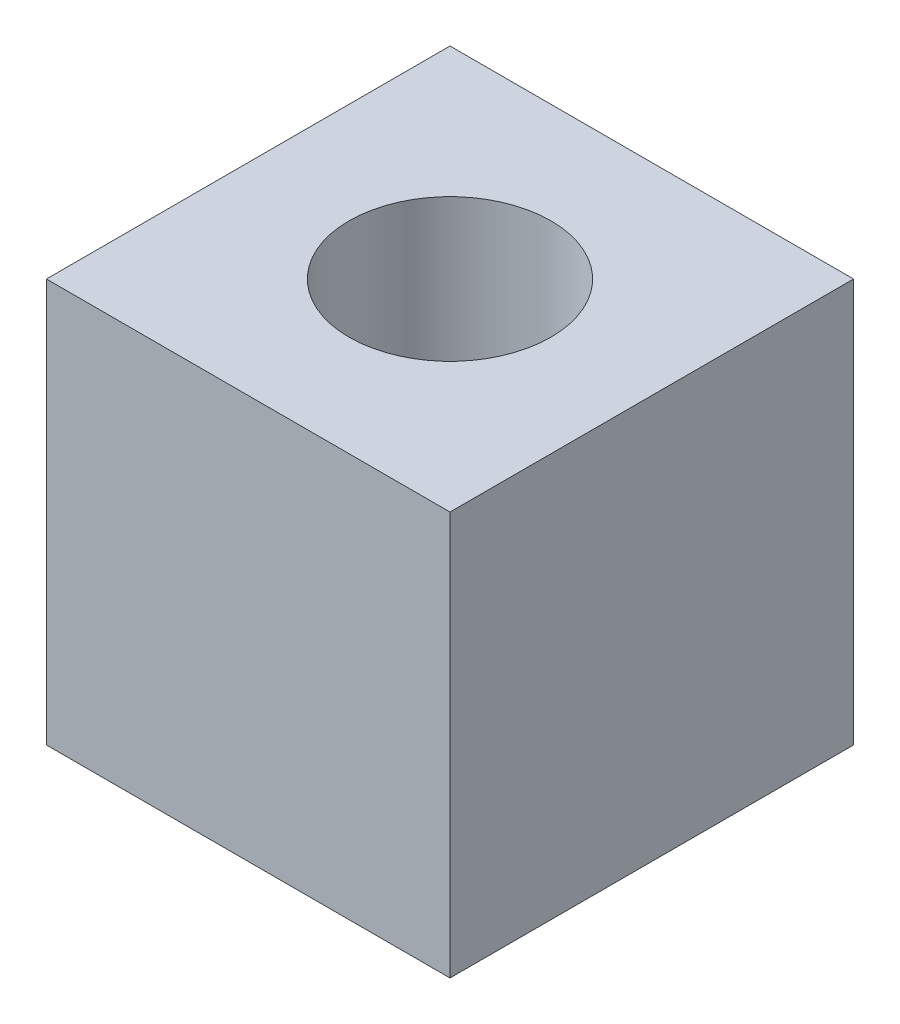
ISO-10303-21;
HEADER;
FILE_DESCRIPTION(('STEP AP214'),'2;1');
FILE_NAME('part.step','',(''),(''),'','','');
FILE_SCHEMA(('AUTOMOTIVE_DESIGN { 1 0 10303 214 1 1 1 1 }'));
ENDSEC;
DATA;
#1=APPLICATION_CONTEXT('core data for automotive mechanical design processes');
#2=APPLICATION_PROTOCOL_DEFINITION('international standard','automotive_design',2000,#1);
#3=PRODUCT_CONTEXT('',#1,'mechanical');
#4=PRODUCT('Part','Part','',(#3));
#5=PRODUCT_RELATED_PRODUCT_CATEGORY('part','',(#4));
#6=PRODUCT_DEFINITION_FORMATION('','',#4);
#7=PRODUCT_DEFINITION_CONTEXT('part definition',#1,'design');
#8=PRODUCT_DEFINITION('design','',#6,#7);
#9=PRODUCT_DEFINITION_SHAPE('','',#8);
#10=(LENGTH_UNIT() NAMED_UNIT(*) SI_UNIT(.MILLI.,.METRE.));
#11=(NAMED_UNIT(*) PLANE_ANGLE_UNIT() SI_UNIT($,.RADIAN.));
#12=(NAMED_UNIT(*) SI_UNIT($,.STERADIAN.) SOLID_ANGLE_UNIT());
#13=UNCERTAINTY_MEASURE_WITH_UNIT(LENGTH_MEASURE(1.E-05),#10,'distance_accuracy_value','');
#14=(GEOMETRIC_REPRESENTATION_CONTEXT(3) GLOBAL_UNCERTAINTY_ASSIGNED_CONTEXT((#13)) GLOBAL_UNIT_ASSIGNED_CONTEXT((#10,
#11,#12)) REPRESENTATION_CONTEXT('',''));
#15=CARTESIAN_POINT('',(0.,0.,0.));
#16=DIRECTION('',(0.,0.,1.));
#17=DIRECTION('',(1.,0.,0.));
#18=AXIS2_PLACEMENT_3D('',#15,#16,#17);
#19=CARTESIAN_POINT('',(0.,0.,50.8));
#20=DIRECTION('',(1.,0.,0.));
#21=DIRECTION('',(0.,1.,0.));
#22=AXIS2_PLACEMENT_3D('',#19,#20,#21);
#23=PLANE('',#22);
#24=DIRECTION('',(0.,-1.,0.));
#25=VECTOR('',#24,1.);
#26=CARTESIAN_POINT('',(0.,0.,0.));
#27=LINE('',#26,#25);
#28=CARTESIAN_POINT('',(0.,0.,0.));
#29=VERTEX_POINT('',#28);
#30=CARTESIAN_POINT('',(0.,-50.8,0.));
#31=VERTEX_POINT('',#30);
#32=EDGE_CURVE('E95',#29,#31,#27,.T.);
#33=ORIENTED_EDGE('',*,*,#32,.T.);
#34=DIRECTION('',(0.,0.,-1.));
#35=VECTOR('',#34,1.);
#36=CARTESIAN_POINT('',(0.,-50.8,50.8));
#37=LINE('',#36,#35);
#38=CARTESIAN_POINT('',(0.,-50.8,50.8));
#39=VERTEX_POINT('',#38);
#40=EDGE_CURVE('E11',#39,#31,#37,.T.);
#41=ORIENTED_EDGE('',*,*,#40,.F.);
#42=DIRECTION('',(0.,-1.,0.));
#43=VECTOR('',#42,1.);
#44=CARTESIAN_POINT('',(0.,0.,50.8));
#45=LINE('',#44,#43);
#46=CARTESIAN_POINT('',(0.,0.,50.8));
#47=VERTEX_POINT('',#46);
#48=EDGE_CURVE('E83',#47,#39,#45,.T.);
#49=ORIENTED_EDGE('',*,*,#48,.F.);
#50=DIRECTION('',(0.,0.,-1.));
#51=VECTOR('',#50,1.);
#52=CARTESIAN_POINT('',(0.,0.,50.8));
#53=LINE('',#52,#51);
#54=EDGE_CURVE('E91',#47,#29,#53,.T.);
#55=ORIENTED_EDGE('',*,*,#54,.T.);
#56=EDGE_LOOP('',(#33,#41,#49,#55));
#57=FACE_BOUND('',#56,.T.);
#58=ADVANCED_FACE('F32',(#57),#23,.F.);
#59=CARTESIAN_POINT('',(0.,-50.8,50.8));
#60=DIRECTION('',(0.,1.,0.));
#61=DIRECTION('',(0.,0.,1.));
#62=AXIS2_PLACEMENT_3D('',#59,#60,#61);
#63=PLANE('',#62);
#64=CARTESIAN_POINT('',(25.4,-50.8,25.4));
#65=DIRECTION('',(0.,1.,0.));
#66=DIRECTION('',(0.,0.,1.));
#67=AXIS2_PLACEMENT_3D('',#64,#65,#66);
#68=CIRCLE('',#67,12.7);
#69=CARTESIAN_POINT('',(25.4,-50.8,38.1));
#70=VERTEX_POINT('',#69);
#71=EDGE_CURVE('E98',#70,#70,#68,.F.);
#72=ORIENTED_EDGE('',*,*,#71,.F.);
#73=EDGE_LOOP('',(#72));
#74=FACE_BOUND('',#73,.T.);
#75=DIRECTION('',(1.,0.,0.));
#76=VECTOR('',#75,1.);
#77=CARTESIAN_POINT('',(0.,-50.8,0.));
#78=LINE('',#77,#76);
#79=CARTESIAN_POINT('',(50.8,-50.8,0.));
#80=VERTEX_POINT('',#79);
#81=EDGE_CURVE('E87',#31,#80,#78,.T.);
#82=ORIENTED_EDGE('',*,*,#81,.T.);
#83=DIRECTION('',(0.,0.,-1.));
#84=VECTOR('',#83,1.);
#85=CARTESIAN_POINT('',(50.8,-50.8,50.8));
#86=LINE('',#85,#84);
#87=CARTESIAN_POINT('',(50.8,-50.8,50.8));
#88=VERTEX_POINT('',#87);
#89=EDGE_CURVE('E40',#88,#80,#86,.T.);
#90=ORIENTED_EDGE('',*,*,#89,.F.);
#91=DIRECTION('',(1.,0.,0.));
#92=VECTOR('',#91,1.);
#93=CARTESIAN_POINT('',(0.,-50.8,50.8));
#94=LINE('',#93,#92);
#95=EDGE_CURVE('E78',#39,#88,#94,.T.);
#96=ORIENTED_EDGE('',*,*,#95,.F.);
#97=ORIENTED_EDGE('',*,*,#40,.T.);
#98=EDGE_LOOP('',(#82,#90,#96,#97));
#99=FACE_BOUND('',#98,.T.);
#100=ADVANCED_FACE('F86',(#74,#99),#63,.F.);
#101=CARTESIAN_POINT('',(50.8,0.,50.8));
#102=DIRECTION('',(-1.,0.,0.));
#103=DIRECTION('',(0.,-1.,0.));
#104=AXIS2_PLACEMENT_3D('',#101,#102,#103);
#105=PLANE('',#104);
#106=DIRECTION('',(0.,1.,0.));
#107=VECTOR('',#106,1.);
#108=CARTESIAN_POINT('',(50.8,0.,0.));
#109=LINE('',#108,#107);
#110=CARTESIAN_POINT('',(50.8,0.,0.));
#111=VERTEX_POINT('',#110);
#112=EDGE_CURVE('E65',#80,#111,#109,.T.);
#113=ORIENTED_EDGE('',*,*,#112,.T.);
#114=DIRECTION('',(0.,0.,-1.));
#115=VECTOR('',#114,1.);
#116=CARTESIAN_POINT('',(50.8,0.,50.8));
#117=LINE('',#116,#115);
#118=CARTESIAN_POINT('',(50.8,0.,50.8));
#119=VERTEX_POINT('',#118);
#120=EDGE_CURVE('E88',#119,#111,#117,.T.);
#121=ORIENTED_EDGE('',*,*,#120,.F.);
#122=DIRECTION('',(0.,1.,0.));
#123=VECTOR('',#122,1.);
#124=CARTESIAN_POINT('',(50.8,0.,50.8));
#125=LINE('',#124,#123);
#126=EDGE_CURVE('E81',#88,#119,#125,.T.);
#127=ORIENTED_EDGE('',*,*,#126,.F.);
#128=ORIENTED_EDGE('',*,*,#89,.T.);
#129=EDGE_LOOP('',(#113,#121,#127,#128));
#130=FACE_BOUND('',#129,.T.);
#131=ADVANCED_FACE('F89',(#130),#105,.F.);
#132=CARTESIAN_POINT('',(0.,0.,50.8));
#133=DIRECTION('',(0.,-1.,0.));
#134=DIRECTION('',(0.,0.,-1.));
#135=AXIS2_PLACEMENT_3D('',#132,#133,#134);
#136=PLANE('',#135);
#137=CARTESIAN_POINT('',(25.4,0.,25.4));
#138=DIRECTION('',(0.,1.,0.));
#139=DIRECTION('',(0.,0.,1.));
#140=AXIS2_PLACEMENT_3D('',#137,#138,#139);
#141=CIRCLE('',#140,12.7);
#142=CARTESIAN_POINT('',(25.4,0.,38.1));
#143=VERTEX_POINT('',#142);
#144=EDGE_CURVE('E111',#143,#143,#141,.T.);
#145=ORIENTED_EDGE('',*,*,#144,.F.);
#146=EDGE_LOOP('',(#145));
#147=FACE_BOUND('',#146,.T.);
#148=DIRECTION('',(-1.,0.,0.));
#149=VECTOR('',#148,1.);
#150=CARTESIAN_POINT('',(0.,0.,0.));
#151=LINE('',#150,#149);
#152=EDGE_CURVE('E71',#111,#29,#151,.T.);
#153=ORIENTED_EDGE('',*,*,#152,.T.);
#154=ORIENTED_EDGE('',*,*,#54,.F.);
#155=DIRECTION('',(-1.,0.,0.));
#156=VECTOR('',#155,1.);
#157=CARTESIAN_POINT('',(0.,0.,50.8));
#158=LINE('',#157,#156);
#159=EDGE_CURVE('E48',#119,#47,#158,.T.);
#160=ORIENTED_EDGE('',*,*,#159,.F.);
#161=ORIENTED_EDGE('',*,*,#120,.T.);
#162=EDGE_LOOP('',(#153,#154,#160,#161));
#163=FACE_BOUND('',#162,.T.);
#164=ADVANCED_FACE('F103',(#147,#163),#136,.F.);
#165=CARTESIAN_POINT('',(0.,0.,50.8));
#166=DIRECTION('',(0.,0.,1.));
#167=DIRECTION('',(1.,0.,0.));
#168=AXIS2_PLACEMENT_3D('',#165,#166,#167);
#169=PLANE('',#168);
#170=ORIENTED_EDGE('',*,*,#48,.T.);
#171=ORIENTED_EDGE('',*,*,#95,.T.);
#172=ORIENTED_EDGE('',*,*,#126,.T.);
#173=ORIENTED_EDGE('',*,*,#159,.T.);
#174=EDGE_LOOP('',(#170,#171,#172,#173));
#175=FACE_BOUND('',#174,.T.);
#176=ADVANCED_FACE('F79',(#175),#169,.T.);
#177=CARTESIAN_POINT('',(0.,0.,0.));
#178=DIRECTION('',(0.,0.,1.));
#179=DIRECTION('',(1.,0.,0.));
#180=AXIS2_PLACEMENT_3D('',#177,#178,#179);
#181=PLANE('',#180);
#182=ORIENTED_EDGE('',*,*,#32,.F.);
#183=ORIENTED_EDGE('',*,*,#152,.F.);
#184=ORIENTED_EDGE('',*,*,#112,.F.);
#185=ORIENTED_EDGE('',*,*,#81,.F.);
#186=EDGE_LOOP('',(#182,#183,#184,#185));
#187=FACE_BOUND('',#186,.T.);
#188=ADVANCED_FACE('F106',(#187),#181,.F.);
#189=CARTESIAN_POINT('',(25.4,-50.801,25.4));
#190=DIRECTION('',(0.,1.,0.));
#191=DIRECTION('',(0.,0.,1.));
#192=AXIS2_PLACEMENT_3D('',#189,#190,#191);
#193=CYLINDRICAL_SURFACE('',#192,12.7);
#194=ORIENTED_EDGE('',*,*,#144,.T.);
#195=EDGE_LOOP('',(#194));
#196=FACE_BOUND('',#195,.T.);
#197=ORIENTED_EDGE('',*,*,#71,.T.);
#198=EDGE_LOOP('',(#197));
#199=FACE_BOUND('',#198,.T.);
#200=ADVANCED_FACE('F115',(#196,#199),#193,.F.);
#201=CLOSED_SHELL('',(#58,#100,#131,#164,#176,#188,#200));
#202=MANIFOLD_SOLID_BREP('B2',#201);
#203=ADVANCED_BREP_SHAPE_REPRESENTATION('',(#18,#202),#14);
#204=SHAPE_DEFINITION_REPRESENTATION(#9,#203);
ENDSEC;
END-ISO-10303-21;
